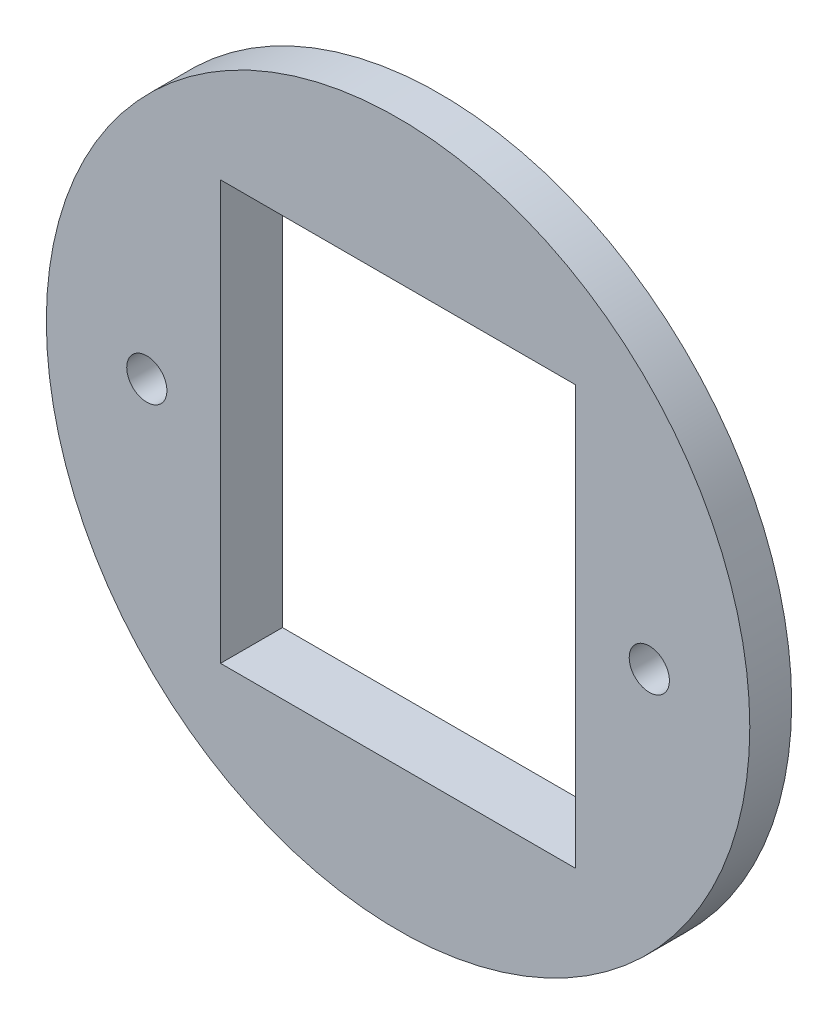
ISO-10303-21;
HEADER;
FILE_DESCRIPTION(('STEP AP214'),'2;1');
FILE_NAME('part.step','',(''),(''),'','','');
FILE_SCHEMA(('AUTOMOTIVE_DESIGN { 1 0 10303 214 1 1 1 1 }'));
ENDSEC;
DATA;
#1=APPLICATION_CONTEXT('core data for automotive mechanical design processes');
#2=APPLICATION_PROTOCOL_DEFINITION('international standard','automotive_design',2000,#1);
#3=PRODUCT_CONTEXT('',#1,'mechanical');
#4=PRODUCT('Part','Part','',(#3));
#5=PRODUCT_RELATED_PRODUCT_CATEGORY('part','',(#4));
#6=PRODUCT_DEFINITION_FORMATION('','',#4);
#7=PRODUCT_DEFINITION_CONTEXT('part definition',#1,'design');
#8=PRODUCT_DEFINITION('design','',#6,#7);
#9=PRODUCT_DEFINITION_SHAPE('','',#8);
#10=(LENGTH_UNIT() NAMED_UNIT(*) SI_UNIT(.MILLI.,.METRE.));
#11=(NAMED_UNIT(*) PLANE_ANGLE_UNIT() SI_UNIT($,.RADIAN.));
#12=(NAMED_UNIT(*) SI_UNIT($,.STERADIAN.) SOLID_ANGLE_UNIT());
#13=UNCERTAINTY_MEASURE_WITH_UNIT(LENGTH_MEASURE(1.E-05),#10,'distance_accuracy_value','');
#14=(GEOMETRIC_REPRESENTATION_CONTEXT(3) GLOBAL_UNCERTAINTY_ASSIGNED_CONTEXT((#13)) GLOBAL_UNIT_ASSIGNED_CONTEXT((#10,
#11,#12)) REPRESENTATION_CONTEXT('',''));
#15=CARTESIAN_POINT('',(0.,0.,0.));
#16=DIRECTION('',(0.,0.,1.));
#17=DIRECTION('',(1.,0.,0.));
#18=AXIS2_PLACEMENT_3D('',#15,#16,#17);
#19=CARTESIAN_POINT('',(0.,-15.875,3.175));
#20=DIRECTION('',(0.,1.,0.));
#21=DIRECTION('',(-1.,0.,0.));
#22=AXIS2_PLACEMENT_3D('',#19,#20,#21);
#23=PLANE('',#22);
#24=DIRECTION('',(0.,0.,-1.));
#25=VECTOR('',#24,1.);
#26=CARTESIAN_POINT('',(13.462,-15.875,3.175));
#27=LINE('',#26,#25);
#28=CARTESIAN_POINT('',(13.462,-15.875,3.175));
#29=VERTEX_POINT('',#28);
#30=CARTESIAN_POINT('',(13.462,-15.875,-1.524));
#31=VERTEX_POINT('',#30);
#32=EDGE_CURVE('E60',#29,#31,#27,.T.);
#33=ORIENTED_EDGE('',*,*,#32,.T.);
#34=DIRECTION('',(1.,0.,0.));
#35=VECTOR('',#34,1.);
#36=CARTESIAN_POINT('',(0.,-15.875,-1.524));
#37=LINE('',#36,#35);
#38=CARTESIAN_POINT('',(-13.462,-15.875,-1.524));
#39=VERTEX_POINT('',#38);
#40=EDGE_CURVE('E87',#39,#31,#37,.T.);
#41=ORIENTED_EDGE('',*,*,#40,.F.);
#42=DIRECTION('',(0.,0.,-1.));
#43=VECTOR('',#42,1.);
#44=CARTESIAN_POINT('',(-13.462,-15.875,3.175));
#45=LINE('',#44,#43);
#46=CARTESIAN_POINT('',(-13.462,-15.875,3.175));
#47=VERTEX_POINT('',#46);
#48=EDGE_CURVE('E11',#47,#39,#45,.T.);
#49=ORIENTED_EDGE('',*,*,#48,.F.);
#50=DIRECTION('',(1.,0.,0.));
#51=VECTOR('',#50,1.);
#52=CARTESIAN_POINT('',(0.,-15.875,3.175));
#53=LINE('',#52,#51);
#54=EDGE_CURVE('E90',#47,#29,#53,.T.);
#55=ORIENTED_EDGE('',*,*,#54,.T.);
#56=EDGE_LOOP('',(#33,#41,#49,#55));
#57=FACE_BOUND('',#56,.T.);
#58=ADVANCED_FACE('F45',(#57),#23,.T.);
#59=CARTESIAN_POINT('',(-13.462,0.,3.175));
#60=DIRECTION('',(-1.,0.,0.));
#61=DIRECTION('',(0.,-1.,0.));
#62=AXIS2_PLACEMENT_3D('',#59,#60,#61);
#63=PLANE('',#62);
#64=ORIENTED_EDGE('',*,*,#48,.T.);
#65=DIRECTION('',(0.,1.,0.));
#66=VECTOR('',#65,1.);
#67=CARTESIAN_POINT('',(-13.462,0.,-1.524));
#68=LINE('',#67,#66);
#69=CARTESIAN_POINT('',(-13.462,15.875,-1.524));
#70=VERTEX_POINT('',#69);
#71=EDGE_CURVE('E103',#39,#70,#68,.T.);
#72=ORIENTED_EDGE('',*,*,#71,.T.);
#73=DIRECTION('',(0.,0.,-1.));
#74=VECTOR('',#73,1.);
#75=CARTESIAN_POINT('',(-13.462,15.875,3.175));
#76=LINE('',#75,#74);
#77=CARTESIAN_POINT('',(-13.462,15.875,3.175));
#78=VERTEX_POINT('',#77);
#79=EDGE_CURVE('E53',#78,#70,#76,.T.);
#80=ORIENTED_EDGE('',*,*,#79,.F.);
#81=DIRECTION('',(0.,1.,0.));
#82=VECTOR('',#81,1.);
#83=CARTESIAN_POINT('',(-13.462,0.,3.175));
#84=LINE('',#83,#82);
#85=EDGE_CURVE('E130',#47,#78,#84,.T.);
#86=ORIENTED_EDGE('',*,*,#85,.F.);
#87=EDGE_LOOP('',(#64,#72,#80,#86));
#88=FACE_BOUND('',#87,.T.);
#89=ADVANCED_FACE('F151',(#88),#63,.F.);
#90=CARTESIAN_POINT('',(0.,15.875,3.175));
#91=DIRECTION('',(0.,1.,0.));
#92=DIRECTION('',(-1.,0.,0.));
#93=AXIS2_PLACEMENT_3D('',#90,#91,#92);
#94=PLANE('',#93);
#95=ORIENTED_EDGE('',*,*,#79,.T.);
#96=DIRECTION('',(1.,0.,0.));
#97=VECTOR('',#96,1.);
#98=CARTESIAN_POINT('',(0.,15.875,-1.524));
#99=LINE('',#98,#97);
#100=CARTESIAN_POINT('',(13.462,15.875,-1.524));
#101=VERTEX_POINT('',#100);
#102=EDGE_CURVE('E120',#70,#101,#99,.T.);
#103=ORIENTED_EDGE('',*,*,#102,.T.);
#104=DIRECTION('',(0.,0.,-1.));
#105=VECTOR('',#104,1.);
#106=CARTESIAN_POINT('',(13.462,15.875,3.175));
#107=LINE('',#106,#105);
#108=CARTESIAN_POINT('',(13.462,15.875,3.175));
#109=VERTEX_POINT('',#108);
#110=EDGE_CURVE('E92',#109,#101,#107,.T.);
#111=ORIENTED_EDGE('',*,*,#110,.F.);
#112=DIRECTION('',(1.,0.,0.));
#113=VECTOR('',#112,1.);
#114=CARTESIAN_POINT('',(0.,15.875,3.175));
#115=LINE('',#114,#113);
#116=EDGE_CURVE('E68',#78,#109,#115,.T.);
#117=ORIENTED_EDGE('',*,*,#116,.F.);
#118=EDGE_LOOP('',(#95,#103,#111,#117));
#119=FACE_BOUND('',#118,.T.);
#120=ADVANCED_FACE('F148',(#119),#94,.F.);
#121=CARTESIAN_POINT('',(13.462,0.,3.175));
#122=DIRECTION('',(-1.,0.,0.));
#123=DIRECTION('',(0.,-1.,0.));
#124=AXIS2_PLACEMENT_3D('',#121,#122,#123);
#125=PLANE('',#124);
#126=ORIENTED_EDGE('',*,*,#110,.T.);
#127=DIRECTION('',(0.,1.,0.));
#128=VECTOR('',#127,1.);
#129=CARTESIAN_POINT('',(13.462,0.,-1.524));
#130=LINE('',#129,#128);
#131=EDGE_CURVE('E100',#31,#101,#130,.T.);
#132=ORIENTED_EDGE('',*,*,#131,.F.);
#133=ORIENTED_EDGE('',*,*,#32,.F.);
#134=DIRECTION('',(0.,1.,0.));
#135=VECTOR('',#134,1.);
#136=CARTESIAN_POINT('',(13.462,0.,3.175));
#137=LINE('',#136,#135);
#138=EDGE_CURVE('E135',#29,#109,#137,.T.);
#139=ORIENTED_EDGE('',*,*,#138,.T.);
#140=EDGE_LOOP('',(#126,#132,#133,#139));
#141=FACE_BOUND('',#140,.T.);
#142=ADVANCED_FACE('F106',(#141),#125,.T.);
#143=CARTESIAN_POINT('',(0.,0.,3.175));
#144=DIRECTION('',(0.,0.,-1.));
#145=DIRECTION('',(-1.,0.,0.));
#146=AXIS2_PLACEMENT_3D('',#143,#144,#145);
#147=CYLINDRICAL_SURFACE('',#146,26.67);
#148=CARTESIAN_POINT('',(0.,0.,3.175));
#149=DIRECTION('',(0.,0.,1.));
#150=DIRECTION('',(1.,0.,0.));
#151=AXIS2_PLACEMENT_3D('',#148,#149,#150);
#152=CIRCLE('',#151,26.67);
#153=CARTESIAN_POINT('',(26.67,0.,3.175));
#154=VERTEX_POINT('',#153);
#155=EDGE_CURVE('E93',#154,#154,#152,.T.);
#156=ORIENTED_EDGE('',*,*,#155,.F.);
#157=EDGE_LOOP('',(#156));
#158=FACE_BOUND('',#157,.T.);
#159=CARTESIAN_POINT('',(0.,0.,0.));
#160=DIRECTION('',(0.,0.,1.));
#161=DIRECTION('',(1.,0.,0.));
#162=AXIS2_PLACEMENT_3D('',#159,#160,#161);
#163=CIRCLE('',#162,26.67);
#164=CARTESIAN_POINT('',(26.67,0.,0.));
#165=VERTEX_POINT('',#164);
#166=EDGE_CURVE('E126',#165,#165,#163,.T.);
#167=ORIENTED_EDGE('',*,*,#166,.T.);
#168=EDGE_LOOP('',(#167));
#169=FACE_BOUND('',#168,.T.);
#170=ADVANCED_FACE('F156',(#158,#169),#147,.T.);
#171=CARTESIAN_POINT('',(0.,0.,3.175));
#172=DIRECTION('',(0.,0.,1.));
#173=DIRECTION('',(1.,0.,0.));
#174=AXIS2_PLACEMENT_3D('',#171,#172,#173);
#175=PLANE('',#174);
#176=CARTESIAN_POINT('',(19.05,0.,3.175));
#177=DIRECTION('',(0.,0.,-1.));
#178=DIRECTION('',(-1.,0.,0.));
#179=AXIS2_PLACEMENT_3D('',#176,#177,#178);
#180=CIRCLE('',#179,1.524);
#181=CARTESIAN_POINT('',(17.526,0.,3.175));
#182=VERTEX_POINT('',#181);
#183=EDGE_CURVE('E112',#182,#182,#180,.T.);
#184=ORIENTED_EDGE('',*,*,#183,.T.);
#185=EDGE_LOOP('',(#184));
#186=FACE_BOUND('',#185,.T.);
#187=CARTESIAN_POINT('',(-19.05,0.,3.175));
#188=DIRECTION('',(0.,0.,-1.));
#189=DIRECTION('',(-1.,0.,0.));
#190=AXIS2_PLACEMENT_3D('',#187,#188,#189);
#191=CIRCLE('',#190,1.524);
#192=CARTESIAN_POINT('',(-20.574,0.,3.175));
#193=VERTEX_POINT('',#192);
#194=EDGE_CURVE('E115',#193,#193,#191,.T.);
#195=ORIENTED_EDGE('',*,*,#194,.T.);
#196=EDGE_LOOP('',(#195));
#197=FACE_BOUND('',#196,.T.);
#198=ORIENTED_EDGE('',*,*,#54,.F.);
#199=ORIENTED_EDGE('',*,*,#85,.T.);
#200=ORIENTED_EDGE('',*,*,#116,.T.);
#201=ORIENTED_EDGE('',*,*,#138,.F.);
#202=EDGE_LOOP('',(#198,#199,#200,#201));
#203=FACE_BOUND('',#202,.T.);
#204=ORIENTED_EDGE('',*,*,#155,.T.);
#205=EDGE_LOOP('',(#204));
#206=FACE_BOUND('',#205,.T.);
#207=ADVANCED_FACE('F152',(#186,#197,#203,#206),#175,.T.);
#208=CARTESIAN_POINT('',(0.,0.,0.));
#209=DIRECTION('',(0.,0.,1.));
#210=DIRECTION('',(1.,0.,0.));
#211=AXIS2_PLACEMENT_3D('',#208,#209,#210);
#212=PLANE('',#211);
#213=CARTESIAN_POINT('',(0.,0.,0.));
#214=DIRECTION('',(0.,0.,1.));
#215=DIRECTION('',(1.,0.,0.));
#216=AXIS2_PLACEMENT_3D('',#213,#214,#215);
#217=CIRCLE('',#216,21.971);
#218=CARTESIAN_POINT('',(21.971,0.,0.));
#219=VERTEX_POINT('',#218);
#220=EDGE_CURVE('E108',#219,#219,#217,.T.);
#221=ORIENTED_EDGE('',*,*,#220,.T.);
#222=EDGE_LOOP('',(#221));
#223=FACE_BOUND('',#222,.T.);
#224=ORIENTED_EDGE('',*,*,#166,.F.);
#225=EDGE_LOOP('',(#224));
#226=FACE_BOUND('',#225,.T.);
#227=ADVANCED_FACE('F155',(#223,#226),#212,.F.);
#228=CARTESIAN_POINT('',(0.,0.,-1.524));
#229=DIRECTION('',(0.,0.,1.));
#230=DIRECTION('',(1.,0.,0.));
#231=AXIS2_PLACEMENT_3D('',#228,#229,#230);
#232=CYLINDRICAL_SURFACE('',#231,21.971);
#233=CARTESIAN_POINT('',(0.,0.,-1.524));
#234=DIRECTION('',(0.,0.,1.));
#235=DIRECTION('',(1.,0.,0.));
#236=AXIS2_PLACEMENT_3D('',#233,#234,#235);
#237=CIRCLE('',#236,21.971);
#238=CARTESIAN_POINT('',(21.971,0.,-1.524));
#239=VERTEX_POINT('',#238);
#240=EDGE_CURVE('E123',#239,#239,#237,.T.);
#241=CARTESIAN_POINT('',(21.971,0.,-1.524));
#242=CARTESIAN_POINT('',(21.971,0.,-1.508125));
#243=CARTESIAN_POINT('',(21.971,0.,-1.49225));
#244=CARTESIAN_POINT('',(21.971,0.,-1.4605));
#245=CARTESIAN_POINT('',(21.971,0.,-1.444625));
#246=CARTESIAN_POINT('',(21.971,0.,-1.412875));
#247=CARTESIAN_POINT('',(21.971,0.,-1.397));
#248=CARTESIAN_POINT('',(21.971,0.,-1.36525));
#249=CARTESIAN_POINT('',(21.971,0.,-1.349375));
#250=CARTESIAN_POINT('',(21.971,0.,-1.317625));
#251=CARTESIAN_POINT('',(21.971,0.,-1.30175));
#252=CARTESIAN_POINT('',(21.971,0.,-1.27));
#253=CARTESIAN_POINT('',(21.971,0.,-1.254125));
#254=CARTESIAN_POINT('',(21.971,0.,-1.222375));
#255=CARTESIAN_POINT('',(21.971,0.,-1.2065));
#256=CARTESIAN_POINT('',(21.971,0.,-1.17475));
#257=CARTESIAN_POINT('',(21.971,0.,-1.158875));
#258=CARTESIAN_POINT('',(21.971,0.,-1.127125));
#259=CARTESIAN_POINT('',(21.971,0.,-1.11125));
#260=CARTESIAN_POINT('',(21.971,0.,-1.0795));
#261=CARTESIAN_POINT('',(21.971,0.,-1.063625));
#262=CARTESIAN_POINT('',(21.971,0.,-1.031875));
#263=CARTESIAN_POINT('',(21.971,0.,-1.016));
#264=CARTESIAN_POINT('',(21.971,0.,-0.98425));
#265=CARTESIAN_POINT('',(21.971,0.,-0.968375));
#266=CARTESIAN_POINT('',(21.971,0.,-0.936625));
#267=CARTESIAN_POINT('',(21.971,0.,-0.92075));
#268=CARTESIAN_POINT('',(21.971,0.,-0.889));
#269=CARTESIAN_POINT('',(21.971,0.,-0.873125));
#270=CARTESIAN_POINT('',(21.971,0.,-0.841375));
#271=CARTESIAN_POINT('',(21.971,0.,-0.8255));
#272=CARTESIAN_POINT('',(21.971,0.,-0.79375));
#273=CARTESIAN_POINT('',(21.971,0.,-0.777875));
#274=CARTESIAN_POINT('',(21.971,0.,-0.746125));
#275=CARTESIAN_POINT('',(21.971,0.,-0.73025));
#276=CARTESIAN_POINT('',(21.971,0.,-0.6985));
#277=CARTESIAN_POINT('',(21.971,0.,-0.682625));
#278=CARTESIAN_POINT('',(21.971,0.,-0.650875));
#279=CARTESIAN_POINT('',(21.971,0.,-0.635));
#280=CARTESIAN_POINT('',(21.971,0.,-0.60325));
#281=CARTESIAN_POINT('',(21.971,0.,-0.587375));
#282=CARTESIAN_POINT('',(21.971,0.,-0.555625));
#283=CARTESIAN_POINT('',(21.971,0.,-0.53975));
#284=CARTESIAN_POINT('',(21.971,0.,-0.508));
#285=CARTESIAN_POINT('',(21.971,0.,-0.492125));
#286=CARTESIAN_POINT('',(21.971,0.,-0.460375));
#287=CARTESIAN_POINT('',(21.971,0.,-0.4445));
#288=CARTESIAN_POINT('',(21.971,0.,-0.41275));
#289=CARTESIAN_POINT('',(21.971,0.,-0.396875));
#290=CARTESIAN_POINT('',(21.971,0.,-0.365125));
#291=CARTESIAN_POINT('',(21.971,0.,-0.34925));
#292=CARTESIAN_POINT('',(21.971,0.,-0.3175));
#293=CARTESIAN_POINT('',(21.971,0.,-0.301625));
#294=CARTESIAN_POINT('',(21.971,0.,-0.269875));
#295=CARTESIAN_POINT('',(21.971,0.,-0.254));
#296=CARTESIAN_POINT('',(21.971,0.,-0.22225));
#297=CARTESIAN_POINT('',(21.971,0.,-0.206375));
#298=CARTESIAN_POINT('',(21.971,0.,-0.174625));
#299=CARTESIAN_POINT('',(21.971,0.,-0.15875));
#300=CARTESIAN_POINT('',(21.971,0.,-0.127));
#301=CARTESIAN_POINT('',(21.971,0.,-0.111125));
#302=CARTESIAN_POINT('',(21.971,0.,-0.079375));
#303=CARTESIAN_POINT('',(21.971,0.,-0.0635));
#304=CARTESIAN_POINT('',(21.971,0.,-0.0317499999999999));
#305=CARTESIAN_POINT('',(21.971,0.,-0.015875));
#306=CARTESIAN_POINT('',(21.971,0.,0.));
#307=B_SPLINE_CURVE_WITH_KNOTS('',3,(#241,#242,#243,#244,#245,#246,#247,#248,#249,#250,#251,
#252,#253,#254,#255,#256,#257,#258,#259,#260,#261,#262,#263,#264,#265,#266,#267,#268,#269,#270,
#271,#272,#273,#274,#275,#276,#277,#278,#279,#280,#281,#282,#283,#284,#285,#286,#287,#288,#289,
#290,#291,#292,#293,#294,#295,#296,#297,#298,#299,#300,#301,#302,#303,#304,#305,#306),
.UNSPECIFIED.,.F.,.F.,(4,2,2,2,2,2,2,2,2,2,2,2,2,2,2,2,2,2,2,2,2,2,2,2,2,2,2,2,2,2,2,2,4),(0.,
0.0476250000000001,0.0952500000000001,0.142875,0.1905,0.238125,0.28575,0.333375,0.381,0.428625,
0.47625,0.523875,0.5715,0.619125,0.66675,0.714375,0.762,0.809625,0.85725,0.904875,0.9525,
1.000125,1.04775,1.095375,1.143,1.190625,1.23825,1.285875,1.3335,1.381125,1.42875,1.476375,
1.524),.UNSPECIFIED.);
#308=EDGE_CURVE('BSEAM167',#239,#219,#307,.T.);
#309=ORIENTED_EDGE('',*,*,#240,.T.);
#310=ORIENTED_EDGE('',*,*,#220,.F.);
#311=ORIENTED_EDGE('',*,*,#308,.T.);
#312=ORIENTED_EDGE('',*,*,#308,.F.);
#313=EDGE_LOOP('',(#309,#311,#310,#312));
#314=FACE_BOUND('',#313,.T.);
#315=ADVANCED_FACE('F167',(#314),#232,.T.);
#316=CARTESIAN_POINT('',(0.,0.,-1.524));
#317=DIRECTION('',(0.,0.,1.));
#318=DIRECTION('',(1.,0.,0.));
#319=AXIS2_PLACEMENT_3D('',#316,#317,#318);
#320=PLANE('',#319);
#321=CARTESIAN_POINT('',(19.05,0.,-1.524));
#322=DIRECTION('',(0.,0.,-1.));
#323=DIRECTION('',(-1.,0.,0.));
#324=AXIS2_PLACEMENT_3D('',#321,#322,#323);
#325=CIRCLE('',#324,1.524);
#326=CARTESIAN_POINT('',(17.526,0.,-1.524));
#327=VERTEX_POINT('',#326);
#328=EDGE_CURVE('E330',#327,#327,#325,.T.);
#329=ORIENTED_EDGE('',*,*,#328,.F.);
#330=EDGE_LOOP('',(#329));
#331=FACE_BOUND('',#330,.T.);
#332=CARTESIAN_POINT('',(-19.05,0.,-1.524));
#333=DIRECTION('',(0.,0.,-1.));
#334=DIRECTION('',(-1.,0.,0.));
#335=AXIS2_PLACEMENT_3D('',#332,#333,#334);
#336=CIRCLE('',#335,1.524);
#337=CARTESIAN_POINT('',(-20.574,0.,-1.524));
#338=VERTEX_POINT('',#337);
#339=EDGE_CURVE('E332',#338,#338,#336,.T.);
#340=ORIENTED_EDGE('',*,*,#339,.F.);
#341=EDGE_LOOP('',(#340));
#342=FACE_BOUND('',#341,.T.);
#343=ORIENTED_EDGE('',*,*,#131,.T.);
#344=ORIENTED_EDGE('',*,*,#102,.F.);
#345=ORIENTED_EDGE('',*,*,#71,.F.);
#346=ORIENTED_EDGE('',*,*,#40,.T.);
#347=EDGE_LOOP('',(#343,#344,#345,#346));
#348=FACE_BOUND('',#347,.T.);
#349=ORIENTED_EDGE('',*,*,#240,.F.);
#350=EDGE_LOOP('',(#349));
#351=FACE_BOUND('',#350,.T.);
#352=ADVANCED_FACE('F97',(#331,#342,#348,#351),#320,.F.);
#353=CARTESIAN_POINT('',(-19.05,0.,3.175));
#354=DIRECTION('',(0.,0.,-1.));
#355=DIRECTION('',(-1.,0.,0.));
#356=AXIS2_PLACEMENT_3D('',#353,#354,#355);
#357=CYLINDRICAL_SURFACE('',#356,1.524);
#358=ORIENTED_EDGE('',*,*,#194,.F.);
#359=EDGE_LOOP('',(#358));
#360=FACE_BOUND('',#359,.T.);
#361=ORIENTED_EDGE('',*,*,#339,.T.);
#362=EDGE_LOOP('',(#361));
#363=FACE_BOUND('',#362,.T.);
#364=ADVANCED_FACE('F211',(#360,#363),#357,.F.);
#365=CARTESIAN_POINT('',(19.05,0.,3.175));
#366=DIRECTION('',(0.,0.,-1.));
#367=DIRECTION('',(-1.,0.,0.));
#368=AXIS2_PLACEMENT_3D('',#365,#366,#367);
#369=CYLINDRICAL_SURFACE('',#368,1.524);
#370=ORIENTED_EDGE('',*,*,#183,.F.);
#371=EDGE_LOOP('',(#370));
#372=FACE_BOUND('',#371,.T.);
#373=ORIENTED_EDGE('',*,*,#328,.T.);
#374=EDGE_LOOP('',(#373));
#375=FACE_BOUND('',#374,.T.);
#376=ADVANCED_FACE('F222',(#372,#375),#369,.F.);
#377=CLOSED_SHELL('',(#58,#89,#120,#142,#170,#207,#227,#315,#352,#364,#376));
#378=MANIFOLD_SOLID_BREP('B2',#377);
#379=ADVANCED_BREP_SHAPE_REPRESENTATION('',(#18,#378),#14);
#380=SHAPE_DEFINITION_REPRESENTATION(#9,#379);
ENDSEC;
END-ISO-10303-21;
